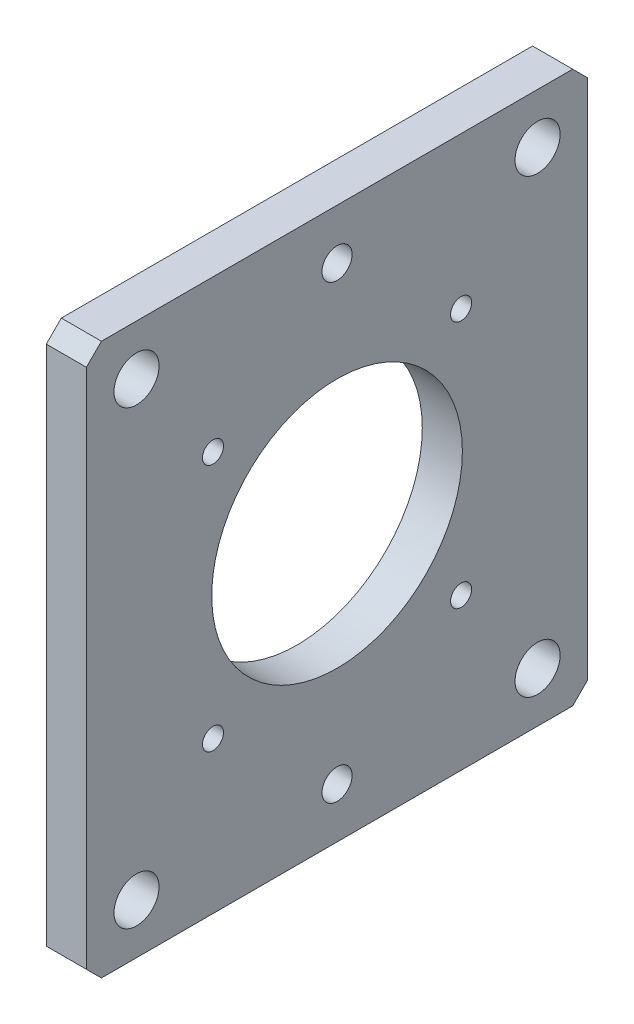
ISO-10303-21;
HEADER;
FILE_DESCRIPTION(('STEP AP214'),'2;1');
FILE_NAME('part.step','',(''),(''),'','','');
FILE_SCHEMA(('AUTOMOTIVE_DESIGN { 1 0 10303 214 1 1 1 1 }'));
ENDSEC;
DATA;
#1=APPLICATION_CONTEXT('core data for automotive mechanical design processes');
#2=APPLICATION_PROTOCOL_DEFINITION('international standard','automotive_design',2000,#1);
#3=PRODUCT_CONTEXT('',#1,'mechanical');
#4=PRODUCT('Part','Part','',(#3));
#5=PRODUCT_RELATED_PRODUCT_CATEGORY('part','',(#4));
#6=PRODUCT_DEFINITION_FORMATION('','',#4);
#7=PRODUCT_DEFINITION_CONTEXT('part definition',#1,'design');
#8=PRODUCT_DEFINITION('design','',#6,#7);
#9=PRODUCT_DEFINITION_SHAPE('','',#8);
#10=(LENGTH_UNIT() NAMED_UNIT(*) SI_UNIT(.MILLI.,.METRE.));
#11=(NAMED_UNIT(*) PLANE_ANGLE_UNIT() SI_UNIT($,.RADIAN.));
#12=(NAMED_UNIT(*) SI_UNIT($,.STERADIAN.) SOLID_ANGLE_UNIT());
#13=UNCERTAINTY_MEASURE_WITH_UNIT(LENGTH_MEASURE(1.E-05),#10,'distance_accuracy_value','');
#14=(GEOMETRIC_REPRESENTATION_CONTEXT(3) GLOBAL_UNCERTAINTY_ASSIGNED_CONTEXT((#13)) GLOBAL_UNIT_ASSIGNED_CONTEXT((#10,
#11,#12)) REPRESENTATION_CONTEXT('',''));
#15=CARTESIAN_POINT('',(0.,0.,0.));
#16=DIRECTION('',(0.,0.,1.));
#17=DIRECTION('',(1.,0.,0.));
#18=AXIS2_PLACEMENT_3D('',#15,#16,#17);
#19=CARTESIAN_POINT('',(-8.00000000000001,0.,-50.));
#20=DIRECTION('',(0.,0.,-1.));
#21=DIRECTION('',(0.,1.,0.));
#22=AXIS2_PLACEMENT_3D('',#19,#20,#21);
#23=PLANE('',#22);
#24=DIRECTION('',(0.,1.,0.));
#25=VECTOR('',#24,1.);
#26=CARTESIAN_POINT('',(-8.00000000000001,0.,-50.));
#27=LINE('',#26,#25);
#28=CARTESIAN_POINT('',(-8.00000000000001,3.00000000000003,-50.));
#29=VERTEX_POINT('',#28);
#30=CARTESIAN_POINT('',(-8.00000000000001,107.,-50.));
#31=VERTEX_POINT('',#30);
#32=EDGE_CURVE('E167',#29,#31,#27,.T.);
#33=ORIENTED_EDGE('',*,*,#32,.T.);
#34=DIRECTION('',(1.,0.,0.));
#35=VECTOR('',#34,1.);
#36=CARTESIAN_POINT('',(-8.00000000000001,107.,-50.));
#37=LINE('',#36,#35);
#38=CARTESIAN_POINT('',(0.,107.,-50.));
#39=VERTEX_POINT('',#38);
#40=EDGE_CURVE('E121',#31,#39,#37,.T.);
#41=ORIENTED_EDGE('',*,*,#40,.T.);
#42=DIRECTION('',(0.,1.,0.));
#43=VECTOR('',#42,1.);
#44=CARTESIAN_POINT('',(0.,0.,-50.));
#45=LINE('',#44,#43);
#46=CARTESIAN_POINT('',(0.,3.00000000000003,-50.));
#47=VERTEX_POINT('',#46);
#48=EDGE_CURVE('E105',#47,#39,#45,.T.);
#49=ORIENTED_EDGE('',*,*,#48,.F.);
#50=DIRECTION('',(-1.,0.,0.));
#51=VECTOR('',#50,1.);
#52=CARTESIAN_POINT('',(-8.00000000000001,3.00000000000003,-50.));
#53=LINE('',#52,#51);
#54=EDGE_CURVE('E118',#47,#29,#53,.T.);
#55=ORIENTED_EDGE('',*,*,#54,.T.);
#56=EDGE_LOOP('',(#33,#41,#49,#55));
#57=FACE_BOUND('',#56,.T.);
#58=ADVANCED_FACE('F36',(#57),#23,.T.);
#59=CARTESIAN_POINT('',(-8.00000000000001,0.,-50.));
#60=DIRECTION('',(0.,-1.,0.));
#61=DIRECTION('',(0.,0.,-1.));
#62=AXIS2_PLACEMENT_3D('',#59,#60,#61);
#63=PLANE('',#62);
#64=DIRECTION('',(0.,0.,-1.));
#65=VECTOR('',#64,1.);
#66=CARTESIAN_POINT('',(-8.00000000000001,0.,-50.));
#67=LINE('',#66,#65);
#68=CARTESIAN_POINT('',(-8.00000000000001,0.,47.));
#69=VERTEX_POINT('',#68);
#70=CARTESIAN_POINT('',(-8.00000000000001,0.,-47.));
#71=VERTEX_POINT('',#70);
#72=EDGE_CURVE('E128',#69,#71,#67,.T.);
#73=ORIENTED_EDGE('',*,*,#72,.T.);
#74=DIRECTION('',(1.,0.,0.));
#75=VECTOR('',#74,1.);
#76=CARTESIAN_POINT('',(-8.00000000000001,0.,-47.));
#77=LINE('',#76,#75);
#78=CARTESIAN_POINT('',(0.,0.,-47.));
#79=VERTEX_POINT('',#78);
#80=EDGE_CURVE('E154',#71,#79,#77,.T.);
#81=ORIENTED_EDGE('',*,*,#80,.T.);
#82=DIRECTION('',(0.,0.,-1.));
#83=VECTOR('',#82,1.);
#84=CARTESIAN_POINT('',(0.,0.,-50.));
#85=LINE('',#84,#83);
#86=CARTESIAN_POINT('',(0.,0.,47.));
#87=VERTEX_POINT('',#86);
#88=EDGE_CURVE('E107',#87,#79,#85,.T.);
#89=ORIENTED_EDGE('',*,*,#88,.F.);
#90=DIRECTION('',(-1.,0.,0.));
#91=VECTOR('',#90,1.);
#92=CARTESIAN_POINT('',(-8.00000000000001,0.,47.));
#93=LINE('',#92,#91);
#94=EDGE_CURVE('E152',#87,#69,#93,.T.);
#95=ORIENTED_EDGE('',*,*,#94,.T.);
#96=EDGE_LOOP('',(#73,#81,#89,#95));
#97=FACE_BOUND('',#96,.T.);
#98=ADVANCED_FACE('F156',(#97),#63,.T.);
#99=CARTESIAN_POINT('',(-8.00000000000001,0.,50.));
#100=DIRECTION('',(0.,0.,1.));
#101=DIRECTION('',(0.,-1.,0.));
#102=AXIS2_PLACEMENT_3D('',#99,#100,#101);
#103=PLANE('',#102);
#104=DIRECTION('',(0.,-1.,0.));
#105=VECTOR('',#104,1.);
#106=CARTESIAN_POINT('',(-8.00000000000001,0.,50.));
#107=LINE('',#106,#105);
#108=CARTESIAN_POINT('',(-8.00000000000001,107.,50.));
#109=VERTEX_POINT('',#108);
#110=CARTESIAN_POINT('',(-8.00000000000001,3.,50.));
#111=VERTEX_POINT('',#110);
#112=EDGE_CURVE('E133',#109,#111,#107,.T.);
#113=ORIENTED_EDGE('',*,*,#112,.T.);
#114=DIRECTION('',(1.,0.,0.));
#115=VECTOR('',#114,1.);
#116=CARTESIAN_POINT('',(-8.00000000000001,3.,50.));
#117=LINE('',#116,#115);
#118=CARTESIAN_POINT('',(0.,3.,50.));
#119=VERTEX_POINT('',#118);
#120=EDGE_CURVE('E11',#111,#119,#117,.T.);
#121=ORIENTED_EDGE('',*,*,#120,.T.);
#122=DIRECTION('',(0.,-1.,0.));
#123=VECTOR('',#122,1.);
#124=CARTESIAN_POINT('',(0.,0.,50.));
#125=LINE('',#124,#123);
#126=CARTESIAN_POINT('',(0.,107.,50.));
#127=VERTEX_POINT('',#126);
#128=EDGE_CURVE('E165',#127,#119,#125,.T.);
#129=ORIENTED_EDGE('',*,*,#128,.F.);
#130=DIRECTION('',(-1.,0.,0.));
#131=VECTOR('',#130,1.);
#132=CARTESIAN_POINT('',(-8.00000000000001,107.,50.));
#133=LINE('',#132,#131);
#134=EDGE_CURVE('E44',#127,#109,#133,.T.);
#135=ORIENTED_EDGE('',*,*,#134,.T.);
#136=EDGE_LOOP('',(#113,#121,#129,#135));
#137=FACE_BOUND('',#136,.T.);
#138=ADVANCED_FACE('F164',(#137),#103,.T.);
#139=CARTESIAN_POINT('',(-8.00000000000001,110.,-50.));
#140=DIRECTION('',(0.,1.,0.));
#141=DIRECTION('',(0.,0.,1.));
#142=AXIS2_PLACEMENT_3D('',#139,#140,#141);
#143=PLANE('',#142);
#144=DIRECTION('',(0.,0.,1.));
#145=VECTOR('',#144,1.);
#146=CARTESIAN_POINT('',(0.,110.,-50.));
#147=LINE('',#146,#145);
#148=CARTESIAN_POINT('',(0.,110.,-47.));
#149=VERTEX_POINT('',#148);
#150=CARTESIAN_POINT('',(0.,110.,47.));
#151=VERTEX_POINT('',#150);
#152=EDGE_CURVE('E122',#149,#151,#147,.T.);
#153=ORIENTED_EDGE('',*,*,#152,.F.);
#154=DIRECTION('',(-1.,0.,0.));
#155=VECTOR('',#154,1.);
#156=CARTESIAN_POINT('',(-8.00000000000001,110.,-47.));
#157=LINE('',#156,#155);
#158=CARTESIAN_POINT('',(-8.00000000000001,110.,-47.));
#159=VERTEX_POINT('',#158);
#160=EDGE_CURVE('E144',#149,#159,#157,.T.);
#161=ORIENTED_EDGE('',*,*,#160,.T.);
#162=DIRECTION('',(0.,0.,1.));
#163=VECTOR('',#162,1.);
#164=CARTESIAN_POINT('',(-8.00000000000001,110.,-50.));
#165=LINE('',#164,#163);
#166=CARTESIAN_POINT('',(-8.00000000000001,110.,47.));
#167=VERTEX_POINT('',#166);
#168=EDGE_CURVE('E171',#159,#167,#165,.T.);
#169=ORIENTED_EDGE('',*,*,#168,.T.);
#170=DIRECTION('',(1.,0.,0.));
#171=VECTOR('',#170,1.);
#172=CARTESIAN_POINT('',(-8.00000000000001,110.,47.));
#173=LINE('',#172,#171);
#174=EDGE_CURVE('E141',#167,#151,#173,.T.);
#175=ORIENTED_EDGE('',*,*,#174,.T.);
#176=EDGE_LOOP('',(#153,#161,#169,#175));
#177=FACE_BOUND('',#176,.T.);
#178=ADVANCED_FACE('F288',(#177),#143,.T.);
#179=CARTESIAN_POINT('',(-8.00000000000001,110.,-50.));
#180=DIRECTION('',(1.,0.,0.));
#181=DIRECTION('',(0.,0.,-1.));
#182=AXIS2_PLACEMENT_3D('',#179,#180,#181);
#183=PLANE('',#182);
#184=CARTESIAN_POINT('',(-8.00000000000001,79.7487373415291,-24.7487373415292));
#185=DIRECTION('',(1.,0.,0.));
#186=DIRECTION('',(0.,0.,-1.));
#187=AXIS2_PLACEMENT_3D('',#184,#185,#186);
#188=CIRCLE('',#187,2.1);
#189=CARTESIAN_POINT('',(-8.00000000000001,79.7487373415291,-26.8487373415292));
#190=VERTEX_POINT('',#189);
#191=EDGE_CURVE('E235',#190,#190,#188,.T.);
#192=ORIENTED_EDGE('',*,*,#191,.T.);
#193=EDGE_LOOP('',(#192));
#194=FACE_BOUND('',#193,.T.);
#195=CARTESIAN_POINT('',(-8.00000000000001,79.7487373415291,24.7487373415292));
#196=DIRECTION('',(1.,0.,0.));
#197=DIRECTION('',(0.,0.,-1.));
#198=AXIS2_PLACEMENT_3D('',#195,#196,#197);
#199=CIRCLE('',#198,2.1);
#200=CARTESIAN_POINT('',(-8.00000000000001,79.7487373415291,22.6487373415292));
#201=VERTEX_POINT('',#200);
#202=EDGE_CURVE('E229',#201,#201,#199,.T.);
#203=ORIENTED_EDGE('',*,*,#202,.T.);
#204=EDGE_LOOP('',(#203));
#205=FACE_BOUND('',#204,.T.);
#206=CARTESIAN_POINT('',(-8.00000000000001,30.2512626584709,24.7487373415292));
#207=DIRECTION('',(1.,0.,0.));
#208=DIRECTION('',(0.,0.,-1.));
#209=AXIS2_PLACEMENT_3D('',#206,#207,#208);
#210=CIRCLE('',#209,2.1);
#211=CARTESIAN_POINT('',(-8.00000000000001,30.2512626584709,22.6487373415292));
#212=VERTEX_POINT('',#211);
#213=EDGE_CURVE('E223',#212,#212,#210,.T.);
#214=ORIENTED_EDGE('',*,*,#213,.T.);
#215=EDGE_LOOP('',(#214));
#216=FACE_BOUND('',#215,.T.);
#217=CARTESIAN_POINT('',(-8.00000000000001,30.2512626584709,-24.7487373415292));
#218=DIRECTION('',(1.,0.,0.));
#219=DIRECTION('',(0.,0.,-1.));
#220=AXIS2_PLACEMENT_3D('',#217,#218,#219);
#221=CIRCLE('',#220,2.1);
#222=CARTESIAN_POINT('',(-8.00000000000001,30.2512626584709,-26.8487373415292));
#223=VERTEX_POINT('',#222);
#224=EDGE_CURVE('E217',#223,#223,#221,.T.);
#225=ORIENTED_EDGE('',*,*,#224,.T.);
#226=EDGE_LOOP('',(#225));
#227=FACE_BOUND('',#226,.T.);
#228=CARTESIAN_POINT('',(-8.00000000000001,100.,40.));
#229=DIRECTION('',(1.,0.,0.));
#230=DIRECTION('',(0.,0.,-1.));
#231=AXIS2_PLACEMENT_3D('',#228,#229,#230);
#232=CIRCLE('',#231,4.5);
#233=CARTESIAN_POINT('',(-8.00000000000001,100.,35.5));
#234=VERTEX_POINT('',#233);
#235=EDGE_CURVE('E210',#234,#234,#232,.T.);
#236=ORIENTED_EDGE('',*,*,#235,.T.);
#237=EDGE_LOOP('',(#236));
#238=FACE_BOUND('',#237,.T.);
#239=CARTESIAN_POINT('',(-8.00000000000001,9.99999999999998,40.));
#240=DIRECTION('',(1.,0.,0.));
#241=DIRECTION('',(0.,0.,-1.));
#242=AXIS2_PLACEMENT_3D('',#239,#240,#241);
#243=CIRCLE('',#242,4.5);
#244=CARTESIAN_POINT('',(-8.00000000000001,9.99999999999998,35.5));
#245=VERTEX_POINT('',#244);
#246=EDGE_CURVE('E204',#245,#245,#243,.T.);
#247=ORIENTED_EDGE('',*,*,#246,.T.);
#248=EDGE_LOOP('',(#247));
#249=FACE_BOUND('',#248,.T.);
#250=CARTESIAN_POINT('',(-8.00000000000001,9.99999999999998,-40.));
#251=DIRECTION('',(1.,0.,0.));
#252=DIRECTION('',(0.,0.,-1.));
#253=AXIS2_PLACEMENT_3D('',#250,#251,#252);
#254=CIRCLE('',#253,4.5);
#255=CARTESIAN_POINT('',(-8.00000000000001,9.99999999999998,-44.5));
#256=VERTEX_POINT('',#255);
#257=EDGE_CURVE('E198',#256,#256,#254,.T.);
#258=ORIENTED_EDGE('',*,*,#257,.T.);
#259=EDGE_LOOP('',(#258));
#260=FACE_BOUND('',#259,.T.);
#261=CARTESIAN_POINT('',(-8.00000000000001,100.,-40.));
#262=DIRECTION('',(1.,0.,0.));
#263=DIRECTION('',(0.,0.,-1.));
#264=AXIS2_PLACEMENT_3D('',#261,#262,#263);
#265=CIRCLE('',#264,4.5);
#266=CARTESIAN_POINT('',(-8.00000000000001,100.,-44.5));
#267=VERTEX_POINT('',#266);
#268=EDGE_CURVE('E190',#267,#267,#265,.T.);
#269=ORIENTED_EDGE('',*,*,#268,.T.);
#270=EDGE_LOOP('',(#269));
#271=FACE_BOUND('',#270,.T.);
#272=CARTESIAN_POINT('',(-8.00000000000001,100.,0.));
#273=DIRECTION('',(-1.,0.,0.));
#274=DIRECTION('',(0.,0.,1.));
#275=AXIS2_PLACEMENT_3D('',#272,#273,#274);
#276=CIRCLE('',#275,3.);
#277=CARTESIAN_POINT('',(-8.00000000000001,100.,3.));
#278=VERTEX_POINT('',#277);
#279=EDGE_CURVE('E187',#278,#278,#276,.T.);
#280=ORIENTED_EDGE('',*,*,#279,.F.);
#281=EDGE_LOOP('',(#280));
#282=FACE_BOUND('',#281,.T.);
#283=CARTESIAN_POINT('',(-8.00000000000001,10.,0.));
#284=DIRECTION('',(-1.,0.,0.));
#285=DIRECTION('',(0.,0.,1.));
#286=AXIS2_PLACEMENT_3D('',#283,#284,#285);
#287=CIRCLE('',#286,3.);
#288=CARTESIAN_POINT('',(-8.00000000000001,10.,3.));
#289=VERTEX_POINT('',#288);
#290=EDGE_CURVE('E181',#289,#289,#287,.T.);
#291=ORIENTED_EDGE('',*,*,#290,.F.);
#292=EDGE_LOOP('',(#291));
#293=FACE_BOUND('',#292,.T.);
#294=CARTESIAN_POINT('',(-8.00000000000001,55.,0.));
#295=DIRECTION('',(1.,0.,0.));
#296=DIRECTION('',(0.,0.,-1.));
#297=AXIS2_PLACEMENT_3D('',#294,#295,#296);
#298=CIRCLE('',#297,25.);
#299=CARTESIAN_POINT('',(-8.00000000000001,55.,-25.));
#300=VERTEX_POINT('',#299);
#301=EDGE_CURVE('E123',#300,#300,#298,.T.);
#302=ORIENTED_EDGE('',*,*,#301,.T.);
#303=EDGE_LOOP('',(#302));
#304=FACE_BOUND('',#303,.T.);
#305=ORIENTED_EDGE('',*,*,#168,.F.);
#306=DIRECTION('',(0.,0.707106781186546,0.707106781186549));
#307=VECTOR('',#306,1.);
#308=CARTESIAN_POINT('',(-8.00000000000001,107.,-50.));
#309=LINE('',#308,#307);
#310=EDGE_CURVE('E150',#159,#31,#309,.F.);
#311=ORIENTED_EDGE('',*,*,#310,.T.);
#312=ORIENTED_EDGE('',*,*,#32,.F.);
#313=DIRECTION('',(0.,0.707106781186549,-0.707106781186546));
#314=VECTOR('',#313,1.);
#315=CARTESIAN_POINT('',(-8.00000000000001,0.,-47.));
#316=LINE('',#315,#314);
#317=EDGE_CURVE('E127',#29,#71,#316,.F.);
#318=ORIENTED_EDGE('',*,*,#317,.T.);
#319=ORIENTED_EDGE('',*,*,#72,.F.);
#320=DIRECTION('',(0.,-0.707106781186546,-0.707106781186549));
#321=VECTOR('',#320,1.);
#322=CARTESIAN_POINT('',(-8.00000000000001,3.,50.));
#323=LINE('',#322,#321);
#324=EDGE_CURVE('E51',#69,#111,#323,.F.);
#325=ORIENTED_EDGE('',*,*,#324,.T.);
#326=ORIENTED_EDGE('',*,*,#112,.F.);
#327=DIRECTION('',(0.,-0.707106781186549,0.707106781186546));
#328=VECTOR('',#327,1.);
#329=CARTESIAN_POINT('',(-8.00000000000001,110.,47.));
#330=LINE('',#329,#328);
#331=EDGE_CURVE('E146',#109,#167,#330,.F.);
#332=ORIENTED_EDGE('',*,*,#331,.T.);
#333=EDGE_LOOP('',(#305,#311,#312,#318,#319,#325,#326,#332));
#334=FACE_BOUND('',#333,.T.);
#335=ADVANCED_FACE('F159',(#194,#205,#216,#227,#238,#249,#260,#271,#282,#293,#304,#334),#183,.F.);
#336=CARTESIAN_POINT('',(0.,110.,-50.));
#337=DIRECTION('',(1.,0.,0.));
#338=DIRECTION('',(0.,0.,-1.));
#339=AXIS2_PLACEMENT_3D('',#336,#337,#338);
#340=PLANE('',#339);
#341=CARTESIAN_POINT('',(0.,79.7487373415291,-24.7487373415292));
#342=DIRECTION('',(1.,0.,0.));
#343=DIRECTION('',(0.,0.,-1.));
#344=AXIS2_PLACEMENT_3D('',#341,#342,#343);
#345=CIRCLE('',#344,2.09999999999999);
#346=CARTESIAN_POINT('',(0.,79.7487373415291,-26.8487373415292));
#347=VERTEX_POINT('',#346);
#348=EDGE_CURVE('E238',#347,#347,#345,.T.);
#349=ORIENTED_EDGE('',*,*,#348,.F.);
#350=EDGE_LOOP('',(#349));
#351=FACE_BOUND('',#350,.T.);
#352=CARTESIAN_POINT('',(0.,79.7487373415291,24.7487373415292));
#353=DIRECTION('',(1.,0.,0.));
#354=DIRECTION('',(0.,0.,-1.));
#355=AXIS2_PLACEMENT_3D('',#352,#353,#354);
#356=CIRCLE('',#355,2.09999999999999);
#357=CARTESIAN_POINT('',(0.,79.7487373415291,22.6487373415292));
#358=VERTEX_POINT('',#357);
#359=EDGE_CURVE('E232',#358,#358,#356,.T.);
#360=ORIENTED_EDGE('',*,*,#359,.F.);
#361=EDGE_LOOP('',(#360));
#362=FACE_BOUND('',#361,.T.);
#363=CARTESIAN_POINT('',(0.,30.2512626584709,24.7487373415292));
#364=DIRECTION('',(1.,0.,0.));
#365=DIRECTION('',(0.,0.,-1.));
#366=AXIS2_PLACEMENT_3D('',#363,#364,#365);
#367=CIRCLE('',#366,2.09999999999999);
#368=CARTESIAN_POINT('',(0.,30.2512626584709,22.6487373415292));
#369=VERTEX_POINT('',#368);
#370=EDGE_CURVE('E226',#369,#369,#367,.T.);
#371=ORIENTED_EDGE('',*,*,#370,.F.);
#372=EDGE_LOOP('',(#371));
#373=FACE_BOUND('',#372,.T.);
#374=CARTESIAN_POINT('',(0.,30.2512626584709,-24.7487373415292));
#375=DIRECTION('',(1.,0.,0.));
#376=DIRECTION('',(0.,0.,-1.));
#377=AXIS2_PLACEMENT_3D('',#374,#375,#376);
#378=CIRCLE('',#377,2.09999999999999);
#379=CARTESIAN_POINT('',(0.,30.2512626584709,-26.8487373415292));
#380=VERTEX_POINT('',#379);
#381=EDGE_CURVE('E220',#380,#380,#378,.T.);
#382=ORIENTED_EDGE('',*,*,#381,.F.);
#383=EDGE_LOOP('',(#382));
#384=FACE_BOUND('',#383,.T.);
#385=CARTESIAN_POINT('',(0.,100.,40.));
#386=DIRECTION('',(1.,0.,0.));
#387=DIRECTION('',(0.,0.,-1.));
#388=AXIS2_PLACEMENT_3D('',#385,#386,#387);
#389=CIRCLE('',#388,4.49999999999999);
#390=CARTESIAN_POINT('',(0.,100.,35.5));
#391=VERTEX_POINT('',#390);
#392=EDGE_CURVE('E214',#391,#391,#389,.T.);
#393=ORIENTED_EDGE('',*,*,#392,.F.);
#394=EDGE_LOOP('',(#393));
#395=FACE_BOUND('',#394,.T.);
#396=CARTESIAN_POINT('',(0.,9.99999999999998,40.));
#397=DIRECTION('',(1.,0.,0.));
#398=DIRECTION('',(0.,0.,-1.));
#399=AXIS2_PLACEMENT_3D('',#396,#397,#398);
#400=CIRCLE('',#399,4.49999999999999);
#401=CARTESIAN_POINT('',(0.,9.99999999999998,35.5));
#402=VERTEX_POINT('',#401);
#403=EDGE_CURVE('E207',#402,#402,#400,.T.);
#404=ORIENTED_EDGE('',*,*,#403,.F.);
#405=EDGE_LOOP('',(#404));
#406=FACE_BOUND('',#405,.T.);
#407=CARTESIAN_POINT('',(0.,9.99999999999998,-40.));
#408=DIRECTION('',(1.,0.,0.));
#409=DIRECTION('',(0.,0.,-1.));
#410=AXIS2_PLACEMENT_3D('',#407,#408,#409);
#411=CIRCLE('',#410,4.49999999999999);
#412=CARTESIAN_POINT('',(0.,9.99999999999998,-44.5));
#413=VERTEX_POINT('',#412);
#414=EDGE_CURVE('E201',#413,#413,#411,.T.);
#415=ORIENTED_EDGE('',*,*,#414,.F.);
#416=EDGE_LOOP('',(#415));
#417=FACE_BOUND('',#416,.T.);
#418=CARTESIAN_POINT('',(0.,100.,-40.));
#419=DIRECTION('',(1.,0.,0.));
#420=DIRECTION('',(0.,0.,-1.));
#421=AXIS2_PLACEMENT_3D('',#418,#419,#420);
#422=CIRCLE('',#421,4.49999999999999);
#423=CARTESIAN_POINT('',(0.,100.,-44.5));
#424=VERTEX_POINT('',#423);
#425=EDGE_CURVE('E195',#424,#424,#422,.T.);
#426=ORIENTED_EDGE('',*,*,#425,.F.);
#427=EDGE_LOOP('',(#426));
#428=FACE_BOUND('',#427,.T.);
#429=CARTESIAN_POINT('',(0.,100.,0.));
#430=DIRECTION('',(-1.,0.,0.));
#431=DIRECTION('',(0.,0.,1.));
#432=AXIS2_PLACEMENT_3D('',#429,#430,#431);
#433=CIRCLE('',#432,3.);
#434=CARTESIAN_POINT('',(0.,100.,3.));
#435=VERTEX_POINT('',#434);
#436=EDGE_CURVE('E184',#435,#435,#433,.T.);
#437=ORIENTED_EDGE('',*,*,#436,.T.);
#438=EDGE_LOOP('',(#437));
#439=FACE_BOUND('',#438,.T.);
#440=CARTESIAN_POINT('',(0.,10.,0.));
#441=DIRECTION('',(-1.,0.,0.));
#442=DIRECTION('',(0.,0.,1.));
#443=AXIS2_PLACEMENT_3D('',#440,#441,#442);
#444=CIRCLE('',#443,3.);
#445=CARTESIAN_POINT('',(0.,10.,3.));
#446=VERTEX_POINT('',#445);
#447=EDGE_CURVE('E178',#446,#446,#444,.T.);
#448=ORIENTED_EDGE('',*,*,#447,.T.);
#449=EDGE_LOOP('',(#448));
#450=FACE_BOUND('',#449,.T.);
#451=CARTESIAN_POINT('',(0.,55.,0.));
#452=DIRECTION('',(1.,0.,0.));
#453=DIRECTION('',(0.,0.,-1.));
#454=AXIS2_PLACEMENT_3D('',#451,#452,#453);
#455=CIRCLE('',#454,25.);
#456=CARTESIAN_POINT('',(0.,55.,-25.));
#457=VERTEX_POINT('',#456);
#458=EDGE_CURVE('E175',#457,#457,#455,.T.);
#459=ORIENTED_EDGE('',*,*,#458,.F.);
#460=EDGE_LOOP('',(#459));
#461=FACE_BOUND('',#460,.T.);
#462=ORIENTED_EDGE('',*,*,#48,.T.);
#463=DIRECTION('',(0.,-0.707106781186546,-0.707106781186549));
#464=VECTOR('',#463,1.);
#465=CARTESIAN_POINT('',(0.,108.5,-48.5));
#466=LINE('',#465,#464);
#467=EDGE_CURVE('E112',#39,#149,#466,.F.);
#468=ORIENTED_EDGE('',*,*,#467,.T.);
#469=ORIENTED_EDGE('',*,*,#152,.T.);
#470=DIRECTION('',(0.,0.707106781186549,-0.707106781186546));
#471=VECTOR('',#470,1.);
#472=CARTESIAN_POINT('',(0.,158.5,-1.49999999999978));
#473=LINE('',#472,#471);
#474=EDGE_CURVE('E130',#151,#127,#473,.F.);
#475=ORIENTED_EDGE('',*,*,#474,.T.);
#476=ORIENTED_EDGE('',*,*,#128,.T.);
#477=DIRECTION('',(0.,0.707106781186546,0.707106781186549));
#478=VECTOR('',#477,1.);
#479=CARTESIAN_POINT('',(0.,6.49999999999973,53.4999999999997));
#480=LINE('',#479,#478);
#481=EDGE_CURVE('E113',#119,#87,#480,.F.);
#482=ORIENTED_EDGE('',*,*,#481,.T.);
#483=ORIENTED_EDGE('',*,*,#88,.T.);
#484=DIRECTION('',(0.,-0.707106781186549,0.707106781186546));
#485=VECTOR('',#484,1.);
#486=CARTESIAN_POINT('',(0.,56.5000000000003,-103.5));
#487=LINE('',#486,#485);
#488=EDGE_CURVE('E102',#79,#47,#487,.F.);
#489=ORIENTED_EDGE('',*,*,#488,.T.);
#490=EDGE_LOOP('',(#462,#468,#469,#475,#476,#482,#483,#489));
#491=FACE_BOUND('',#490,.T.);
#492=ADVANCED_FACE('F104',(#351,#362,#373,#384,#395,#406,#417,#428,#439,#450,#461,#491),#340,.T.);
#493=CARTESIAN_POINT('',(-8.00000000000001,55.,0.));
#494=DIRECTION('',(1.,0.,0.));
#495=DIRECTION('',(0.,0.,-1.));
#496=AXIS2_PLACEMENT_3D('',#493,#494,#495);
#497=CYLINDRICAL_SURFACE('',#496,25.);
#498=ORIENTED_EDGE('',*,*,#301,.F.);
#499=EDGE_LOOP('',(#498));
#500=FACE_BOUND('',#499,.T.);
#501=ORIENTED_EDGE('',*,*,#458,.T.);
#502=EDGE_LOOP('',(#501));
#503=FACE_BOUND('',#502,.T.);
#504=ADVANCED_FACE('F246',(#500,#503),#497,.F.);
#505=CARTESIAN_POINT('',(0.,10.,0.));
#506=DIRECTION('',(-1.,0.,0.));
#507=DIRECTION('',(0.,0.,1.));
#508=AXIS2_PLACEMENT_3D('',#505,#506,#507);
#509=CYLINDRICAL_SURFACE('',#508,3.);
#510=ORIENTED_EDGE('',*,*,#447,.F.);
#511=EDGE_LOOP('',(#510));
#512=FACE_BOUND('',#511,.T.);
#513=ORIENTED_EDGE('',*,*,#290,.T.);
#514=EDGE_LOOP('',(#513));
#515=FACE_BOUND('',#514,.T.);
#516=ADVANCED_FACE('F269',(#512,#515),#509,.F.);
#517=CARTESIAN_POINT('',(0.,100.,0.));
#518=DIRECTION('',(-1.,0.,0.));
#519=DIRECTION('',(0.,0.,1.));
#520=AXIS2_PLACEMENT_3D('',#517,#518,#519);
#521=CYLINDRICAL_SURFACE('',#520,3.);
#522=ORIENTED_EDGE('',*,*,#436,.F.);
#523=EDGE_LOOP('',(#522));
#524=FACE_BOUND('',#523,.T.);
#525=ORIENTED_EDGE('',*,*,#279,.T.);
#526=EDGE_LOOP('',(#525));
#527=FACE_BOUND('',#526,.T.);
#528=ADVANCED_FACE('F275',(#524,#527),#521,.F.);
#529=CARTESIAN_POINT('',(0.,100.,-40.));
#530=DIRECTION('',(1.,0.,0.));
#531=DIRECTION('',(0.,0.,-1.));
#532=AXIS2_PLACEMENT_3D('',#529,#530,#531);
#533=CYLINDRICAL_SURFACE('',#532,4.5);
#534=ORIENTED_EDGE('',*,*,#268,.F.);
#535=EDGE_LOOP('',(#534));
#536=FACE_BOUND('',#535,.T.);
#537=ORIENTED_EDGE('',*,*,#425,.T.);
#538=EDGE_LOOP('',(#537));
#539=FACE_BOUND('',#538,.T.);
#540=ADVANCED_FACE('F360',(#536,#539),#533,.F.);
#541=CARTESIAN_POINT('',(0.,9.99999999999998,-40.));
#542=DIRECTION('',(1.,0.,0.));
#543=DIRECTION('',(0.,0.,-1.));
#544=AXIS2_PLACEMENT_3D('',#541,#542,#543);
#545=CYLINDRICAL_SURFACE('',#544,4.49999999999999);
#546=ORIENTED_EDGE('',*,*,#257,.F.);
#547=EDGE_LOOP('',(#546));
#548=FACE_BOUND('',#547,.T.);
#549=ORIENTED_EDGE('',*,*,#414,.T.);
#550=EDGE_LOOP('',(#549));
#551=FACE_BOUND('',#550,.T.);
#552=ADVANCED_FACE('F369',(#548,#551),#545,.F.);
#553=CARTESIAN_POINT('',(0.,9.99999999999998,40.));
#554=DIRECTION('',(1.,0.,0.));
#555=DIRECTION('',(0.,0.,-1.));
#556=AXIS2_PLACEMENT_3D('',#553,#554,#555);
#557=CYLINDRICAL_SURFACE('',#556,4.49999999999999);
#558=ORIENTED_EDGE('',*,*,#246,.F.);
#559=EDGE_LOOP('',(#558));
#560=FACE_BOUND('',#559,.T.);
#561=ORIENTED_EDGE('',*,*,#403,.T.);
#562=EDGE_LOOP('',(#561));
#563=FACE_BOUND('',#562,.T.);
#564=ADVANCED_FACE('F378',(#560,#563),#557,.F.);
#565=CARTESIAN_POINT('',(0.,100.,40.));
#566=DIRECTION('',(1.,0.,0.));
#567=DIRECTION('',(0.,0.,-1.));
#568=AXIS2_PLACEMENT_3D('',#565,#566,#567);
#569=CYLINDRICAL_SURFACE('',#568,4.5);
#570=ORIENTED_EDGE('',*,*,#235,.F.);
#571=EDGE_LOOP('',(#570));
#572=FACE_BOUND('',#571,.T.);
#573=ORIENTED_EDGE('',*,*,#392,.T.);
#574=EDGE_LOOP('',(#573));
#575=FACE_BOUND('',#574,.T.);
#576=ADVANCED_FACE('F387',(#572,#575),#569,.F.);
#577=CARTESIAN_POINT('',(0.,30.2512626584709,-24.7487373415292));
#578=DIRECTION('',(1.,0.,0.));
#579=DIRECTION('',(0.,0.,-1.));
#580=AXIS2_PLACEMENT_3D('',#577,#578,#579);
#581=CYLINDRICAL_SURFACE('',#580,2.09999999999999);
#582=ORIENTED_EDGE('',*,*,#224,.F.);
#583=EDGE_LOOP('',(#582));
#584=FACE_BOUND('',#583,.T.);
#585=ORIENTED_EDGE('',*,*,#381,.T.);
#586=EDGE_LOOP('',(#585));
#587=FACE_BOUND('',#586,.T.);
#588=ADVANCED_FACE('F396',(#584,#587),#581,.F.);
#589=CARTESIAN_POINT('',(0.,30.2512626584709,24.7487373415292));
#590=DIRECTION('',(1.,0.,0.));
#591=DIRECTION('',(0.,0.,-1.));
#592=AXIS2_PLACEMENT_3D('',#589,#590,#591);
#593=CYLINDRICAL_SURFACE('',#592,2.09999999999999);
#594=ORIENTED_EDGE('',*,*,#213,.F.);
#595=EDGE_LOOP('',(#594));
#596=FACE_BOUND('',#595,.T.);
#597=ORIENTED_EDGE('',*,*,#370,.T.);
#598=EDGE_LOOP('',(#597));
#599=FACE_BOUND('',#598,.T.);
#600=ADVANCED_FACE('F406',(#596,#599),#593,.F.);
#601=CARTESIAN_POINT('',(0.,79.7487373415291,24.7487373415292));
#602=DIRECTION('',(1.,0.,0.));
#603=DIRECTION('',(0.,0.,-1.));
#604=AXIS2_PLACEMENT_3D('',#601,#602,#603);
#605=CYLINDRICAL_SURFACE('',#604,2.1);
#606=ORIENTED_EDGE('',*,*,#202,.F.);
#607=EDGE_LOOP('',(#606));
#608=FACE_BOUND('',#607,.T.);
#609=ORIENTED_EDGE('',*,*,#359,.T.);
#610=EDGE_LOOP('',(#609));
#611=FACE_BOUND('',#610,.T.);
#612=ADVANCED_FACE('F415',(#608,#611),#605,.F.);
#613=CARTESIAN_POINT('',(0.,79.7487373415291,-24.7487373415292));
#614=DIRECTION('',(1.,0.,0.));
#615=DIRECTION('',(0.,0.,-1.));
#616=AXIS2_PLACEMENT_3D('',#613,#614,#615);
#617=CYLINDRICAL_SURFACE('',#616,2.1);
#618=ORIENTED_EDGE('',*,*,#191,.F.);
#619=EDGE_LOOP('',(#618));
#620=FACE_BOUND('',#619,.T.);
#621=ORIENTED_EDGE('',*,*,#348,.T.);
#622=EDGE_LOOP('',(#621));
#623=FACE_BOUND('',#622,.T.);
#624=ADVANCED_FACE('F242',(#620,#623),#617,.F.);
#625=CARTESIAN_POINT('',(-8.00000000000001,107.,-50.));
#626=DIRECTION('',(0.,-0.707106781186549,0.707106781186546));
#627=DIRECTION('',(0.,-0.707106781186546,-0.707106781186549));
#628=AXIS2_PLACEMENT_3D('',#625,#626,#627);
#629=PLANE('',#628);
#630=ORIENTED_EDGE('',*,*,#310,.F.);
#631=ORIENTED_EDGE('',*,*,#160,.F.);
#632=ORIENTED_EDGE('',*,*,#467,.F.);
#633=ORIENTED_EDGE('',*,*,#40,.F.);
#634=EDGE_LOOP('',(#630,#631,#632,#633));
#635=FACE_BOUND('',#634,.T.);
#636=ADVANCED_FACE('F290',(#635),#629,.F.);
#637=CARTESIAN_POINT('',(-8.00000000000001,0.,-47.));
#638=DIRECTION('',(0.,0.707106781186546,0.707106781186549));
#639=DIRECTION('',(0.,-0.707106781186549,0.707106781186546));
#640=AXIS2_PLACEMENT_3D('',#637,#638,#639);
#641=PLANE('',#640);
#642=ORIENTED_EDGE('',*,*,#317,.F.);
#643=ORIENTED_EDGE('',*,*,#54,.F.);
#644=ORIENTED_EDGE('',*,*,#488,.F.);
#645=ORIENTED_EDGE('',*,*,#80,.F.);
#646=EDGE_LOOP('',(#642,#643,#644,#645));
#647=FACE_BOUND('',#646,.T.);
#648=ADVANCED_FACE('F126',(#647),#641,.F.);
#649=CARTESIAN_POINT('',(-8.00000000000001,3.,50.));
#650=DIRECTION('',(0.,0.707106781186549,-0.707106781186546));
#651=DIRECTION('',(0.,0.707106781186546,0.707106781186549));
#652=AXIS2_PLACEMENT_3D('',#649,#650,#651);
#653=PLANE('',#652);
#654=ORIENTED_EDGE('',*,*,#324,.F.);
#655=ORIENTED_EDGE('',*,*,#94,.F.);
#656=ORIENTED_EDGE('',*,*,#481,.F.);
#657=ORIENTED_EDGE('',*,*,#120,.F.);
#658=EDGE_LOOP('',(#654,#655,#656,#657));
#659=FACE_BOUND('',#658,.T.);
#660=ADVANCED_FACE('F162',(#659),#653,.F.);
#661=CARTESIAN_POINT('',(-8.00000000000001,110.,47.));
#662=DIRECTION('',(0.,-0.707106781186546,-0.707106781186549));
#663=DIRECTION('',(0.,0.707106781186549,-0.707106781186546));
#664=AXIS2_PLACEMENT_3D('',#661,#662,#663);
#665=PLANE('',#664);
#666=ORIENTED_EDGE('',*,*,#331,.F.);
#667=ORIENTED_EDGE('',*,*,#134,.F.);
#668=ORIENTED_EDGE('',*,*,#474,.F.);
#669=ORIENTED_EDGE('',*,*,#174,.F.);
#670=EDGE_LOOP('',(#666,#667,#668,#669));
#671=FACE_BOUND('',#670,.T.);
#672=ADVANCED_FACE('F38',(#671),#665,.F.);
#673=CLOSED_SHELL('',(#58,#98,#138,#178,#335,#492,#504,#516,#528,#540,#552,#564,#576,#588,#600,
#612,#624,#636,#648,#660,#672));
#674=MANIFOLD_SOLID_BREP('B2',#673);
#675=ADVANCED_BREP_SHAPE_REPRESENTATION('',(#18,#674),#14);
#676=SHAPE_DEFINITION_REPRESENTATION(#9,#675);
ENDSEC;
END-ISO-10303-21;
